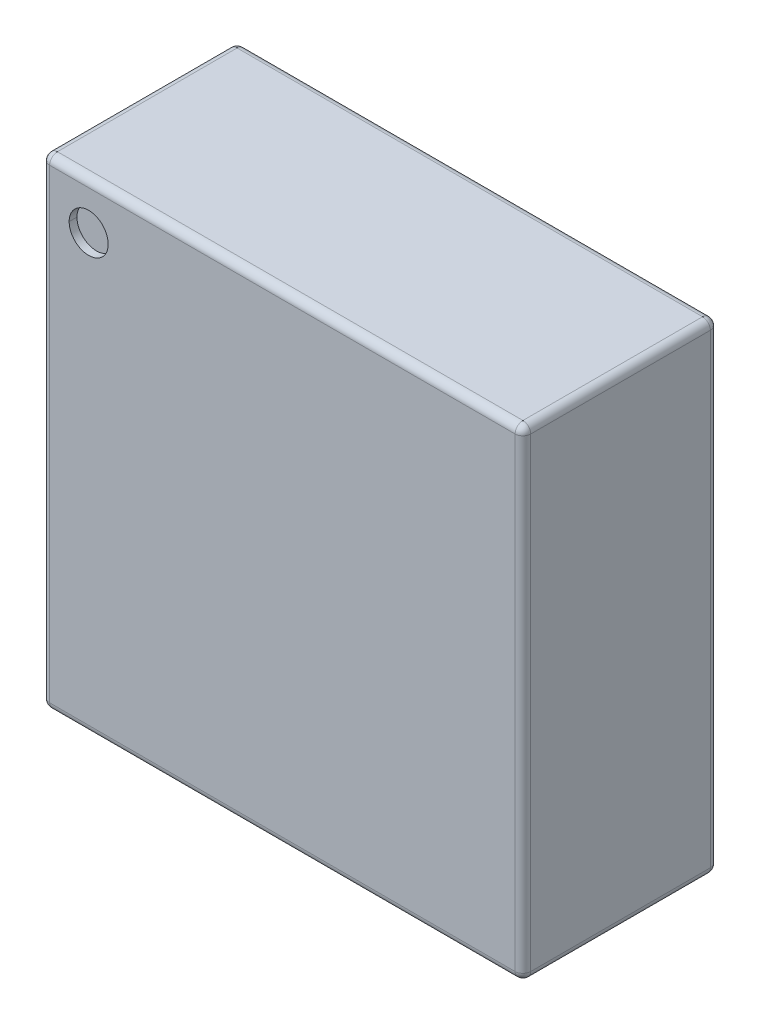
ISO-10303-21;
HEADER;
FILE_DESCRIPTION(('STEP AP214'),'2;1');
FILE_NAME('part.step','',(''),(''),'','','');
FILE_SCHEMA(('AUTOMOTIVE_DESIGN { 1 0 10303 214 1 1 1 1 }'));
ENDSEC;
DATA;
#1=APPLICATION_CONTEXT('core data for automotive mechanical design processes');
#2=APPLICATION_PROTOCOL_DEFINITION('international standard','automotive_design',2000,#1);
#3=PRODUCT_CONTEXT('',#1,'mechanical');
#4=PRODUCT('Part','Part','',(#3));
#5=PRODUCT_RELATED_PRODUCT_CATEGORY('part','',(#4));
#6=PRODUCT_DEFINITION_FORMATION('','',#4);
#7=PRODUCT_DEFINITION_CONTEXT('part definition',#1,'design');
#8=PRODUCT_DEFINITION('design','',#6,#7);
#9=PRODUCT_DEFINITION_SHAPE('','',#8);
#10=(LENGTH_UNIT() NAMED_UNIT(*) SI_UNIT(.MILLI.,.METRE.));
#11=(NAMED_UNIT(*) PLANE_ANGLE_UNIT() SI_UNIT($,.RADIAN.));
#12=(NAMED_UNIT(*) SI_UNIT($,.STERADIAN.) SOLID_ANGLE_UNIT());
#13=UNCERTAINTY_MEASURE_WITH_UNIT(LENGTH_MEASURE(1.E-05),#10,'distance_accuracy_value','');
#14=(GEOMETRIC_REPRESENTATION_CONTEXT(3) GLOBAL_UNCERTAINTY_ASSIGNED_CONTEXT((#13)) GLOBAL_UNIT_ASSIGNED_CONTEXT((#10,
#11,#12)) REPRESENTATION_CONTEXT('',''));
#15=CARTESIAN_POINT('',(0.,0.,0.));
#16=DIRECTION('',(0.,0.,1.));
#17=DIRECTION('',(1.,0.,0.));
#18=AXIS2_PLACEMENT_3D('',#15,#16,#17);
#19=CARTESIAN_POINT('',(-0.248,0.248,0.24));
#20=DIRECTION('',(0.,0.,1.));
#21=DIRECTION('',(1.,0.,0.));
#22=AXIS2_PLACEMENT_3D('',#19,#20,#21);
#23=CYLINDRICAL_SURFACE('',#22,0.025);
#24=CARTESIAN_POINT('',(-0.248,0.248,0.24));
#25=DIRECTION('',(0.,0.,1.));
#26=DIRECTION('',(1.,0.,0.));
#27=AXIS2_PLACEMENT_3D('',#24,#25,#26);
#28=CIRCLE('',#27,0.025);
#29=CARTESIAN_POINT('',(-0.273,0.248,0.24));
#30=VERTEX_POINT('',#29);
#31=CARTESIAN_POINT('',(-0.223,0.248,0.24));
#32=VERTEX_POINT('',#31);
#33=EDGE_CURVE('E11',#30,#32,#28,.T.);
#34=ORIENTED_EDGE('',*,*,#33,.F.);
#35=DIRECTION('',(0.,0.,1.));
#36=VECTOR('',#35,1.);
#37=CARTESIAN_POINT('',(-0.273,0.248,0.24));
#38=LINE('',#37,#36);
#39=CARTESIAN_POINT('',(-0.273,0.248,0.25));
#40=VERTEX_POINT('',#39);
#41=EDGE_CURVE('E24',#30,#40,#38,.T.);
#42=ORIENTED_EDGE('',*,*,#41,.T.);
#43=CARTESIAN_POINT('',(-0.248,0.248,0.25));
#44=DIRECTION('',(0.,0.,1.));
#45=DIRECTION('',(1.,0.,0.));
#46=AXIS2_PLACEMENT_3D('',#43,#44,#45);
#47=CIRCLE('',#46,0.025);
#48=CARTESIAN_POINT('',(-0.223,0.248,0.25));
#49=VERTEX_POINT('',#48);
#50=EDGE_CURVE('E257',#40,#49,#47,.T.);
#51=ORIENTED_EDGE('',*,*,#50,.T.);
#52=DIRECTION('',(0.,0.,1.));
#53=VECTOR('',#52,1.);
#54=CARTESIAN_POINT('',(-0.223,0.248,0.24));
#55=LINE('',#54,#53);
#56=EDGE_CURVE('E37',#32,#49,#55,.T.);
#57=ORIENTED_EDGE('',*,*,#56,.F.);
#58=EDGE_LOOP('',(#34,#42,#51,#57));
#59=FACE_BOUND('',#58,.T.);
#60=ADVANCED_FACE('F17',(#59),#23,.F.);
#61=CARTESIAN_POINT('',(0.308,-0.308,0.25));
#62=DIRECTION('',(-1.,0.,0.));
#63=DIRECTION('',(0.,0.,1.));
#64=AXIS2_PLACEMENT_3D('',#61,#62,#63);
#65=PLANE('',#64);
#66=DIRECTION('',(0.,0.,-1.));
#67=VECTOR('',#66,1.);
#68=CARTESIAN_POINT('',(0.308,-0.298,0.25));
#69=LINE('',#68,#67);
#70=CARTESIAN_POINT('',(0.308,-0.298,0.24));
#71=VERTEX_POINT('',#70);
#72=CARTESIAN_POINT('',(0.308,-0.298,0.01));
#73=VERTEX_POINT('',#72);
#74=EDGE_CURVE('E254',#71,#73,#69,.T.);
#75=ORIENTED_EDGE('',*,*,#74,.T.);
#76=DIRECTION('',(0.,1.,0.));
#77=VECTOR('',#76,1.);
#78=CARTESIAN_POINT('',(0.308,0.298,0.01));
#79=LINE('',#78,#77);
#80=CARTESIAN_POINT('',(0.308,0.298,0.01));
#81=VERTEX_POINT('',#80);
#82=EDGE_CURVE('E252',#73,#81,#79,.T.);
#83=ORIENTED_EDGE('',*,*,#82,.T.);
#84=DIRECTION('',(0.,0.,1.));
#85=VECTOR('',#84,1.);
#86=CARTESIAN_POINT('',(0.308,0.298,0.25));
#87=LINE('',#86,#85);
#88=CARTESIAN_POINT('',(0.308,0.298,0.24));
#89=VERTEX_POINT('',#88);
#90=EDGE_CURVE('E250',#81,#89,#87,.T.);
#91=ORIENTED_EDGE('',*,*,#90,.T.);
#92=DIRECTION('',(0.,-1.,0.));
#93=VECTOR('',#92,1.);
#94=CARTESIAN_POINT('',(0.308,-0.308,0.24));
#95=LINE('',#94,#93);
#96=EDGE_CURVE('E247',#89,#71,#95,.T.);
#97=ORIENTED_EDGE('',*,*,#96,.T.);
#98=EDGE_LOOP('',(#75,#83,#91,#97));
#99=FACE_BOUND('',#98,.T.);
#100=ADVANCED_FACE('F331',(#99),#65,.F.);
#101=CARTESIAN_POINT('',(-0.308,0.308,0.25));
#102=DIRECTION('',(0.,-1.,0.));
#103=DIRECTION('',(0.,0.,-1.));
#104=AXIS2_PLACEMENT_3D('',#101,#102,#103);
#105=PLANE('',#104);
#106=DIRECTION('',(0.,0.,-1.));
#107=VECTOR('',#106,1.);
#108=CARTESIAN_POINT('',(0.298,0.308,0.25));
#109=LINE('',#108,#107);
#110=CARTESIAN_POINT('',(0.298,0.308,0.24));
#111=VERTEX_POINT('',#110);
#112=CARTESIAN_POINT('',(0.298,0.308,0.01));
#113=VERTEX_POINT('',#112);
#114=EDGE_CURVE('E245',#111,#113,#109,.T.);
#115=ORIENTED_EDGE('',*,*,#114,.T.);
#116=DIRECTION('',(-1.,0.,0.));
#117=VECTOR('',#116,1.);
#118=CARTESIAN_POINT('',(-0.298,0.308,0.01));
#119=LINE('',#118,#117);
#120=CARTESIAN_POINT('',(-0.298,0.308,0.01));
#121=VERTEX_POINT('',#120);
#122=EDGE_CURVE('E151',#113,#121,#119,.T.);
#123=ORIENTED_EDGE('',*,*,#122,.T.);
#124=DIRECTION('',(0.,0.,1.));
#125=VECTOR('',#124,1.);
#126=CARTESIAN_POINT('',(-0.298,0.308,0.25));
#127=LINE('',#126,#125);
#128=CARTESIAN_POINT('',(-0.298,0.308,0.24));
#129=VERTEX_POINT('',#128);
#130=EDGE_CURVE('E242',#121,#129,#127,.T.);
#131=ORIENTED_EDGE('',*,*,#130,.T.);
#132=DIRECTION('',(1.,0.,0.));
#133=VECTOR('',#132,1.);
#134=CARTESIAN_POINT('',(-0.308,0.308,0.24));
#135=LINE('',#134,#133);
#136=EDGE_CURVE('E239',#129,#111,#135,.T.);
#137=ORIENTED_EDGE('',*,*,#136,.T.);
#138=EDGE_LOOP('',(#115,#123,#131,#137));
#139=FACE_BOUND('',#138,.T.);
#140=ADVANCED_FACE('F313',(#139),#105,.F.);
#141=CARTESIAN_POINT('',(-0.308,-0.308,0.25));
#142=DIRECTION('',(1.,0.,0.));
#143=DIRECTION('',(0.,0.,-1.));
#144=AXIS2_PLACEMENT_3D('',#141,#142,#143);
#145=PLANE('',#144);
#146=DIRECTION('',(0.,0.,-1.));
#147=VECTOR('',#146,1.);
#148=CARTESIAN_POINT('',(-0.308,0.298,0.25));
#149=LINE('',#148,#147);
#150=CARTESIAN_POINT('',(-0.308,0.298,0.24));
#151=VERTEX_POINT('',#150);
#152=CARTESIAN_POINT('',(-0.308,0.298,0.01));
#153=VERTEX_POINT('',#152);
#154=EDGE_CURVE('E237',#151,#153,#149,.T.);
#155=ORIENTED_EDGE('',*,*,#154,.T.);
#156=DIRECTION('',(0.,-1.,0.));
#157=VECTOR('',#156,1.);
#158=CARTESIAN_POINT('',(-0.308,-0.298,0.01));
#159=LINE('',#158,#157);
#160=CARTESIAN_POINT('',(-0.308,-0.298,0.01));
#161=VERTEX_POINT('',#160);
#162=EDGE_CURVE('E235',#153,#161,#159,.T.);
#163=ORIENTED_EDGE('',*,*,#162,.T.);
#164=DIRECTION('',(0.,0.,1.));
#165=VECTOR('',#164,1.);
#166=CARTESIAN_POINT('',(-0.308,-0.298,0.25));
#167=LINE('',#166,#165);
#168=CARTESIAN_POINT('',(-0.308,-0.298,0.24));
#169=VERTEX_POINT('',#168);
#170=EDGE_CURVE('E233',#161,#169,#167,.T.);
#171=ORIENTED_EDGE('',*,*,#170,.T.);
#172=DIRECTION('',(0.,1.,0.));
#173=VECTOR('',#172,1.);
#174=CARTESIAN_POINT('',(-0.308,-0.308,0.24));
#175=LINE('',#174,#173);
#176=EDGE_CURVE('E230',#169,#151,#175,.T.);
#177=ORIENTED_EDGE('',*,*,#176,.T.);
#178=EDGE_LOOP('',(#155,#163,#171,#177));
#179=FACE_BOUND('',#178,.T.);
#180=ADVANCED_FACE('F339',(#179),#145,.F.);
#181=CARTESIAN_POINT('',(-0.308,-0.308,0.25));
#182=DIRECTION('',(0.,1.,0.));
#183=DIRECTION('',(0.,0.,1.));
#184=AXIS2_PLACEMENT_3D('',#181,#182,#183);
#185=PLANE('',#184);
#186=DIRECTION('',(0.,0.,-1.));
#187=VECTOR('',#186,1.);
#188=CARTESIAN_POINT('',(-0.298,-0.308,0.25));
#189=LINE('',#188,#187);
#190=CARTESIAN_POINT('',(-0.298,-0.308,0.24));
#191=VERTEX_POINT('',#190);
#192=CARTESIAN_POINT('',(-0.298,-0.308,0.01));
#193=VERTEX_POINT('',#192);
#194=EDGE_CURVE('E228',#191,#193,#189,.T.);
#195=ORIENTED_EDGE('',*,*,#194,.T.);
#196=DIRECTION('',(1.,0.,0.));
#197=VECTOR('',#196,1.);
#198=CARTESIAN_POINT('',(0.298,-0.308,0.01));
#199=LINE('',#198,#197);
#200=CARTESIAN_POINT('',(0.298,-0.308,0.01));
#201=VERTEX_POINT('',#200);
#202=EDGE_CURVE('E226',#193,#201,#199,.T.);
#203=ORIENTED_EDGE('',*,*,#202,.T.);
#204=DIRECTION('',(0.,0.,1.));
#205=VECTOR('',#204,1.);
#206=CARTESIAN_POINT('',(0.298,-0.308,0.25));
#207=LINE('',#206,#205);
#208=CARTESIAN_POINT('',(0.298,-0.308,0.24));
#209=VERTEX_POINT('',#208);
#210=EDGE_CURVE('E224',#201,#209,#207,.T.);
#211=ORIENTED_EDGE('',*,*,#210,.T.);
#212=DIRECTION('',(-1.,0.,0.));
#213=VECTOR('',#212,1.);
#214=CARTESIAN_POINT('',(-0.308,-0.308,0.24));
#215=LINE('',#214,#213);
#216=EDGE_CURVE('E221',#209,#191,#215,.T.);
#217=ORIENTED_EDGE('',*,*,#216,.T.);
#218=EDGE_LOOP('',(#195,#203,#211,#217));
#219=FACE_BOUND('',#218,.T.);
#220=ADVANCED_FACE('F264',(#219),#185,.F.);
#221=CARTESIAN_POINT('',(0.,0.,0.25));
#222=DIRECTION('',(0.,0.,-1.));
#223=DIRECTION('',(-1.,0.,0.));
#224=AXIS2_PLACEMENT_3D('',#221,#222,#223);
#225=PLANE('',#224);
#226=CARTESIAN_POINT('',(-0.248,0.248,0.25));
#227=DIRECTION('',(0.,0.,1.));
#228=DIRECTION('',(1.,0.,0.));
#229=AXIS2_PLACEMENT_3D('',#226,#227,#228);
#230=CIRCLE('',#229,0.025);
#231=EDGE_CURVE('E219',#49,#40,#230,.T.);
#232=ORIENTED_EDGE('',*,*,#231,.F.);
#233=ORIENTED_EDGE('',*,*,#50,.F.);
#234=EDGE_LOOP('',(#232,#233));
#235=FACE_BOUND('',#234,.T.);
#236=DIRECTION('',(0.,-1.,0.));
#237=VECTOR('',#236,1.);
#238=CARTESIAN_POINT('',(-0.298,0.,0.25));
#239=LINE('',#238,#237);
#240=CARTESIAN_POINT('',(-0.298,0.298,0.25));
#241=VERTEX_POINT('',#240);
#242=CARTESIAN_POINT('',(-0.298,-0.298,0.25));
#243=VERTEX_POINT('',#242);
#244=EDGE_CURVE('E217',#241,#243,#239,.T.);
#245=ORIENTED_EDGE('',*,*,#244,.T.);
#246=DIRECTION('',(1.,0.,0.));
#247=VECTOR('',#246,1.);
#248=CARTESIAN_POINT('',(0.,-0.298,0.25));
#249=LINE('',#248,#247);
#250=CARTESIAN_POINT('',(0.298,-0.298,0.25));
#251=VERTEX_POINT('',#250);
#252=EDGE_CURVE('E215',#243,#251,#249,.T.);
#253=ORIENTED_EDGE('',*,*,#252,.T.);
#254=DIRECTION('',(0.,1.,0.));
#255=VECTOR('',#254,1.);
#256=CARTESIAN_POINT('',(0.298,0.,0.25));
#257=LINE('',#256,#255);
#258=CARTESIAN_POINT('',(0.298,0.298,0.25));
#259=VERTEX_POINT('',#258);
#260=EDGE_CURVE('E213',#251,#259,#257,.T.);
#261=ORIENTED_EDGE('',*,*,#260,.T.);
#262=DIRECTION('',(-1.,0.,0.));
#263=VECTOR('',#262,1.);
#264=CARTESIAN_POINT('',(0.,0.298,0.25));
#265=LINE('',#264,#263);
#266=EDGE_CURVE('E210',#259,#241,#265,.T.);
#267=ORIENTED_EDGE('',*,*,#266,.T.);
#268=EDGE_LOOP('',(#245,#253,#261,#267));
#269=FACE_BOUND('',#268,.T.);
#270=ADVANCED_FACE('F261',(#235,#269),#225,.F.);
#271=CARTESIAN_POINT('',(0.,0.,0.));
#272=DIRECTION('',(0.,0.,-1.));
#273=DIRECTION('',(-1.,0.,0.));
#274=AXIS2_PLACEMENT_3D('',#271,#272,#273);
#275=PLANE('',#274);
#276=DIRECTION('',(-1.,0.,0.));
#277=VECTOR('',#276,1.);
#278=CARTESIAN_POINT('',(-0.298,-0.298,0.));
#279=LINE('',#278,#277);
#280=CARTESIAN_POINT('',(0.298,-0.298,0.));
#281=VERTEX_POINT('',#280);
#282=CARTESIAN_POINT('',(-0.298,-0.298,0.));
#283=VERTEX_POINT('',#282);
#284=EDGE_CURVE('E208',#281,#283,#279,.T.);
#285=ORIENTED_EDGE('',*,*,#284,.T.);
#286=DIRECTION('',(0.,1.,0.));
#287=VECTOR('',#286,1.);
#288=CARTESIAN_POINT('',(-0.298,0.298,0.));
#289=LINE('',#288,#287);
#290=CARTESIAN_POINT('',(-0.298,0.298,0.));
#291=VERTEX_POINT('',#290);
#292=EDGE_CURVE('E123',#283,#291,#289,.T.);
#293=ORIENTED_EDGE('',*,*,#292,.T.);
#294=DIRECTION('',(1.,0.,0.));
#295=VECTOR('',#294,1.);
#296=CARTESIAN_POINT('',(0.298,0.298,0.));
#297=LINE('',#296,#295);
#298=CARTESIAN_POINT('',(0.298,0.298,0.));
#299=VERTEX_POINT('',#298);
#300=EDGE_CURVE('E117',#291,#299,#297,.T.);
#301=ORIENTED_EDGE('',*,*,#300,.T.);
#302=DIRECTION('',(0.,-1.,0.));
#303=VECTOR('',#302,1.);
#304=CARTESIAN_POINT('',(0.298,-0.298,0.));
#305=LINE('',#304,#303);
#306=EDGE_CURVE('E120',#299,#281,#305,.T.);
#307=ORIENTED_EDGE('',*,*,#306,.T.);
#308=EDGE_LOOP('',(#285,#293,#301,#307));
#309=FACE_BOUND('',#308,.T.);
#310=ADVANCED_FACE('F119',(#309),#275,.T.);
#311=CARTESIAN_POINT('',(-0.298,0.298,0.25));
#312=DIRECTION('',(0.,0.,-1.));
#313=DIRECTION('',(-1.,0.,0.));
#314=AXIS2_PLACEMENT_3D('',#311,#312,#313);
#315=CYLINDRICAL_SURFACE('',#314,0.01);
#316=ORIENTED_EDGE('',*,*,#130,.F.);
#317=CARTESIAN_POINT('',(-0.298,0.298,0.01));
#318=DIRECTION('',(0.,0.,1.));
#319=DIRECTION('',(-1.,0.,0.));
#320=AXIS2_PLACEMENT_3D('',#317,#318,#319);
#321=CIRCLE('',#320,0.01);
#322=EDGE_CURVE('E138',#121,#153,#321,.T.);
#323=ORIENTED_EDGE('',*,*,#322,.T.);
#324=ORIENTED_EDGE('',*,*,#154,.F.);
#325=CARTESIAN_POINT('',(-0.298,0.298,0.24));
#326=DIRECTION('',(0.,0.,1.));
#327=DIRECTION('',(1.,0.,0.));
#328=AXIS2_PLACEMENT_3D('',#325,#326,#327);
#329=CIRCLE('',#328,0.01);
#330=EDGE_CURVE('E202',#129,#151,#329,.T.);
#331=ORIENTED_EDGE('',*,*,#330,.F.);
#332=EDGE_LOOP('',(#316,#323,#324,#331));
#333=FACE_BOUND('',#332,.T.);
#334=ADVANCED_FACE('F317',(#333),#315,.T.);
#335=CARTESIAN_POINT('',(0.,0.298,0.24));
#336=DIRECTION('',(-1.,0.,0.));
#337=DIRECTION('',(0.,0.,1.));
#338=AXIS2_PLACEMENT_3D('',#335,#336,#337);
#339=CYLINDRICAL_SURFACE('',#338,0.01);
#340=CARTESIAN_POINT('',(0.298,0.298,0.24));
#341=DIRECTION('',(1.,0.,0.));
#342=DIRECTION('',(0.,0.,-1.));
#343=AXIS2_PLACEMENT_3D('',#340,#341,#342);
#344=CIRCLE('',#343,0.01);
#345=EDGE_CURVE('E199',#111,#259,#344,.T.);
#346=ORIENTED_EDGE('',*,*,#345,.F.);
#347=ORIENTED_EDGE('',*,*,#136,.F.);
#348=CARTESIAN_POINT('',(-0.298,0.298,0.24));
#349=DIRECTION('',(-1.,0.,0.));
#350=DIRECTION('',(0.,0.,1.));
#351=AXIS2_PLACEMENT_3D('',#348,#349,#350);
#352=CIRCLE('',#351,0.01);
#353=EDGE_CURVE('E196',#241,#129,#352,.T.);
#354=ORIENTED_EDGE('',*,*,#353,.F.);
#355=ORIENTED_EDGE('',*,*,#266,.F.);
#356=EDGE_LOOP('',(#346,#347,#354,#355));
#357=FACE_BOUND('',#356,.T.);
#358=ADVANCED_FACE('F304',(#357),#339,.T.);
#359=CARTESIAN_POINT('',(0.298,0.298,0.25));
#360=DIRECTION('',(0.,0.,-1.));
#361=DIRECTION('',(-1.,0.,0.));
#362=AXIS2_PLACEMENT_3D('',#359,#360,#361);
#363=CYLINDRICAL_SURFACE('',#362,0.01);
#364=ORIENTED_EDGE('',*,*,#90,.F.);
#365=CARTESIAN_POINT('',(0.298,0.298,0.01));
#366=DIRECTION('',(0.,0.,1.));
#367=DIRECTION('',(-1.,0.,0.));
#368=AXIS2_PLACEMENT_3D('',#365,#366,#367);
#369=CIRCLE('',#368,0.01);
#370=EDGE_CURVE('E146',#81,#113,#369,.T.);
#371=ORIENTED_EDGE('',*,*,#370,.T.);
#372=ORIENTED_EDGE('',*,*,#114,.F.);
#373=CARTESIAN_POINT('',(0.298,0.298,0.24));
#374=DIRECTION('',(0.,0.,1.));
#375=DIRECTION('',(1.,0.,0.));
#376=AXIS2_PLACEMENT_3D('',#373,#374,#375);
#377=CIRCLE('',#376,0.01);
#378=EDGE_CURVE('E192',#89,#111,#377,.T.);
#379=ORIENTED_EDGE('',*,*,#378,.F.);
#380=EDGE_LOOP('',(#364,#371,#372,#379));
#381=FACE_BOUND('',#380,.T.);
#382=ADVANCED_FACE('F311',(#381),#363,.T.);
#383=CARTESIAN_POINT('',(-0.298,0.298,0.24));
#384=DIRECTION('',(0.,1.,0.));
#385=DIRECTION('',(1.,0.,0.));
#386=AXIS2_PLACEMENT_3D('',#383,#384,#385);
#387=SPHERICAL_SURFACE('',#386,0.01);
#388=ORIENTED_EDGE('',*,*,#353,.T.);
#389=ORIENTED_EDGE('',*,*,#330,.T.);
#390=CARTESIAN_POINT('',(-0.298,0.298,0.24));
#391=DIRECTION('',(0.,-1.,0.));
#392=DIRECTION('',(0.,0.,1.));
#393=AXIS2_PLACEMENT_3D('',#390,#391,#392);
#394=CIRCLE('',#393,0.01);
#395=EDGE_CURVE('E189',#241,#151,#394,.T.);
#396=ORIENTED_EDGE('',*,*,#395,.F.);
#397=EDGE_LOOP('',(#388,#389,#396));
#398=FACE_BOUND('',#397,.T.);
#399=ADVANCED_FACE('F320',(#398),#387,.T.);
#400=CARTESIAN_POINT('',(0.298,0.298,0.24));
#401=DIRECTION('',(0.,1.,0.));
#402=DIRECTION('',(1.,0.,0.));
#403=AXIS2_PLACEMENT_3D('',#400,#401,#402);
#404=SPHERICAL_SURFACE('',#403,0.01);
#405=ORIENTED_EDGE('',*,*,#378,.T.);
#406=ORIENTED_EDGE('',*,*,#345,.T.);
#407=CARTESIAN_POINT('',(0.298,0.298,0.24));
#408=DIRECTION('',(0.,-1.,0.));
#409=DIRECTION('',(0.,0.,1.));
#410=AXIS2_PLACEMENT_3D('',#407,#408,#409);
#411=CIRCLE('',#410,0.01);
#412=EDGE_CURVE('E186',#89,#259,#411,.T.);
#413=ORIENTED_EDGE('',*,*,#412,.F.);
#414=EDGE_LOOP('',(#405,#406,#413));
#415=FACE_BOUND('',#414,.T.);
#416=ADVANCED_FACE('F308',(#415),#404,.T.);
#417=CARTESIAN_POINT('',(-0.298,-0.298,0.25));
#418=DIRECTION('',(0.,0.,-1.));
#419=DIRECTION('',(-1.,0.,0.));
#420=AXIS2_PLACEMENT_3D('',#417,#418,#419);
#421=CYLINDRICAL_SURFACE('',#420,0.01);
#422=ORIENTED_EDGE('',*,*,#170,.F.);
#423=CARTESIAN_POINT('',(-0.298,-0.298,0.01));
#424=DIRECTION('',(0.,0.,1.));
#425=DIRECTION('',(-1.,0.,0.));
#426=AXIS2_PLACEMENT_3D('',#423,#424,#425);
#427=CIRCLE('',#426,0.01);
#428=EDGE_CURVE('E183',#161,#193,#427,.T.);
#429=ORIENTED_EDGE('',*,*,#428,.T.);
#430=ORIENTED_EDGE('',*,*,#194,.F.);
#431=CARTESIAN_POINT('',(-0.298,-0.298,0.24));
#432=DIRECTION('',(0.,0.,1.));
#433=DIRECTION('',(1.,0.,0.));
#434=AXIS2_PLACEMENT_3D('',#431,#432,#433);
#435=CIRCLE('',#434,0.01);
#436=EDGE_CURVE('E180',#169,#191,#435,.T.);
#437=ORIENTED_EDGE('',*,*,#436,.F.);
#438=EDGE_LOOP('',(#422,#429,#430,#437));
#439=FACE_BOUND('',#438,.T.);
#440=ADVANCED_FACE('F284',(#439),#421,.T.);
#441=CARTESIAN_POINT('',(-0.298,0.,0.24));
#442=DIRECTION('',(0.,-1.,0.));
#443=DIRECTION('',(0.,0.,-1.));
#444=AXIS2_PLACEMENT_3D('',#441,#442,#443);
#445=CYLINDRICAL_SURFACE('',#444,0.01);
#446=ORIENTED_EDGE('',*,*,#395,.T.);
#447=ORIENTED_EDGE('',*,*,#176,.F.);
#448=CARTESIAN_POINT('',(-0.298,-0.298,0.24));
#449=DIRECTION('',(0.,-1.,0.));
#450=DIRECTION('',(0.,0.,-1.));
#451=AXIS2_PLACEMENT_3D('',#448,#449,#450);
#452=CIRCLE('',#451,0.01);
#453=EDGE_CURVE('E177',#243,#169,#452,.T.);
#454=ORIENTED_EDGE('',*,*,#453,.F.);
#455=ORIENTED_EDGE('',*,*,#244,.F.);
#456=EDGE_LOOP('',(#446,#447,#454,#455));
#457=FACE_BOUND('',#456,.T.);
#458=ADVANCED_FACE('F278',(#457),#445,.T.);
#459=CARTESIAN_POINT('',(0.298,0.,0.24));
#460=DIRECTION('',(0.,1.,0.));
#461=DIRECTION('',(0.,0.,1.));
#462=AXIS2_PLACEMENT_3D('',#459,#460,#461);
#463=CYLINDRICAL_SURFACE('',#462,0.01);
#464=ORIENTED_EDGE('',*,*,#412,.T.);
#465=ORIENTED_EDGE('',*,*,#260,.F.);
#466=CARTESIAN_POINT('',(0.298,-0.298,0.24));
#467=DIRECTION('',(0.,-1.,0.));
#468=DIRECTION('',(0.,0.,-1.));
#469=AXIS2_PLACEMENT_3D('',#466,#467,#468);
#470=CIRCLE('',#469,0.01);
#471=EDGE_CURVE('E174',#71,#251,#470,.T.);
#472=ORIENTED_EDGE('',*,*,#471,.F.);
#473=ORIENTED_EDGE('',*,*,#96,.F.);
#474=EDGE_LOOP('',(#464,#465,#472,#473));
#475=FACE_BOUND('',#474,.T.);
#476=ADVANCED_FACE('F299',(#475),#463,.T.);
#477=CARTESIAN_POINT('',(0.298,-0.298,0.25));
#478=DIRECTION('',(0.,0.,-1.));
#479=DIRECTION('',(-1.,0.,0.));
#480=AXIS2_PLACEMENT_3D('',#477,#478,#479);
#481=CYLINDRICAL_SURFACE('',#480,0.01);
#482=ORIENTED_EDGE('',*,*,#210,.F.);
#483=CARTESIAN_POINT('',(0.298,-0.298,0.01));
#484=DIRECTION('',(0.,0.,1.));
#485=DIRECTION('',(-1.,0.,0.));
#486=AXIS2_PLACEMENT_3D('',#483,#484,#485);
#487=CIRCLE('',#486,0.01);
#488=EDGE_CURVE('E171',#201,#73,#487,.T.);
#489=ORIENTED_EDGE('',*,*,#488,.T.);
#490=ORIENTED_EDGE('',*,*,#74,.F.);
#491=CARTESIAN_POINT('',(0.298,-0.298,0.24));
#492=DIRECTION('',(0.,0.,1.));
#493=DIRECTION('',(1.,0.,0.));
#494=AXIS2_PLACEMENT_3D('',#491,#492,#493);
#495=CIRCLE('',#494,0.01);
#496=EDGE_CURVE('E168',#209,#71,#495,.T.);
#497=ORIENTED_EDGE('',*,*,#496,.F.);
#498=EDGE_LOOP('',(#482,#489,#490,#497));
#499=FACE_BOUND('',#498,.T.);
#500=ADVANCED_FACE('F292',(#499),#481,.T.);
#501=CARTESIAN_POINT('',(-0.298,-0.298,0.24));
#502=DIRECTION('',(0.,1.,0.));
#503=DIRECTION('',(1.,0.,0.));
#504=AXIS2_PLACEMENT_3D('',#501,#502,#503);
#505=SPHERICAL_SURFACE('',#504,0.01);
#506=ORIENTED_EDGE('',*,*,#453,.T.);
#507=ORIENTED_EDGE('',*,*,#436,.T.);
#508=CARTESIAN_POINT('',(-0.298,-0.298,0.24));
#509=DIRECTION('',(1.,0.,0.));
#510=DIRECTION('',(0.,0.,1.));
#511=AXIS2_PLACEMENT_3D('',#508,#509,#510);
#512=CIRCLE('',#511,0.01);
#513=EDGE_CURVE('E165',#243,#191,#512,.T.);
#514=ORIENTED_EDGE('',*,*,#513,.F.);
#515=EDGE_LOOP('',(#506,#507,#514));
#516=FACE_BOUND('',#515,.T.);
#517=ADVANCED_FACE('F281',(#516),#505,.T.);
#518=CARTESIAN_POINT('',(0.298,-0.298,0.24));
#519=DIRECTION('',(0.,1.,0.));
#520=DIRECTION('',(1.,0.,0.));
#521=AXIS2_PLACEMENT_3D('',#518,#519,#520);
#522=SPHERICAL_SURFACE('',#521,0.01);
#523=ORIENTED_EDGE('',*,*,#496,.T.);
#524=ORIENTED_EDGE('',*,*,#471,.T.);
#525=CARTESIAN_POINT('',(0.298,-0.298,0.24));
#526=DIRECTION('',(-1.,0.,0.));
#527=DIRECTION('',(0.,0.,-1.));
#528=AXIS2_PLACEMENT_3D('',#525,#526,#527);
#529=CIRCLE('',#528,0.01);
#530=EDGE_CURVE('E162',#209,#251,#529,.T.);
#531=ORIENTED_EDGE('',*,*,#530,.F.);
#532=EDGE_LOOP('',(#523,#524,#531));
#533=FACE_BOUND('',#532,.T.);
#534=ADVANCED_FACE('F295',(#533),#522,.T.);
#535=CARTESIAN_POINT('',(0.,-0.298,0.24));
#536=DIRECTION('',(1.,0.,0.));
#537=DIRECTION('',(0.,0.,-1.));
#538=AXIS2_PLACEMENT_3D('',#535,#536,#537);
#539=CYLINDRICAL_SURFACE('',#538,0.01);
#540=ORIENTED_EDGE('',*,*,#513,.T.);
#541=ORIENTED_EDGE('',*,*,#216,.F.);
#542=ORIENTED_EDGE('',*,*,#530,.T.);
#543=ORIENTED_EDGE('',*,*,#252,.F.);
#544=EDGE_LOOP('',(#540,#541,#542,#543));
#545=FACE_BOUND('',#544,.T.);
#546=ADVANCED_FACE('F273',(#545),#539,.T.);
#547=CARTESIAN_POINT('',(-0.248,0.248,0.24));
#548=DIRECTION('',(0.,0.,1.));
#549=DIRECTION('',(1.,0.,0.));
#550=AXIS2_PLACEMENT_3D('',#547,#548,#549);
#551=CYLINDRICAL_SURFACE('',#550,0.025);
#552=ORIENTED_EDGE('',*,*,#41,.F.);
#553=CARTESIAN_POINT('',(-0.248,0.248,0.24));
#554=DIRECTION('',(0.,0.,1.));
#555=DIRECTION('',(1.,0.,0.));
#556=AXIS2_PLACEMENT_3D('',#553,#554,#555);
#557=CIRCLE('',#556,0.025);
#558=EDGE_CURVE('E147',#32,#30,#557,.T.);
#559=ORIENTED_EDGE('',*,*,#558,.F.);
#560=ORIENTED_EDGE('',*,*,#56,.T.);
#561=ORIENTED_EDGE('',*,*,#231,.T.);
#562=EDGE_LOOP('',(#552,#559,#560,#561));
#563=FACE_BOUND('',#562,.T.);
#564=ADVANCED_FACE('F259',(#563),#551,.F.);
#565=CARTESIAN_POINT('',(-0.248,0.248,0.24));
#566=DIRECTION('',(0.,0.,1.));
#567=DIRECTION('',(1.,0.,0.));
#568=AXIS2_PLACEMENT_3D('',#565,#566,#567);
#569=PLANE('',#568);
#570=ORIENTED_EDGE('',*,*,#558,.T.);
#571=ORIENTED_EDGE('',*,*,#33,.T.);
#572=EDGE_LOOP('',(#570,#571));
#573=FACE_BOUND('',#572,.T.);
#574=ADVANCED_FACE('F440',(#573),#569,.T.);
#575=CARTESIAN_POINT('',(0.298,-0.308,0.01));
#576=DIRECTION('',(0.,-1.,0.));
#577=DIRECTION('',(0.,0.,-1.));
#578=AXIS2_PLACEMENT_3D('',#575,#576,#577);
#579=CYLINDRICAL_SURFACE('',#578,0.01);
#580=CARTESIAN_POINT('',(0.298,0.298,0.01));
#581=DIRECTION('',(0.,1.,0.));
#582=DIRECTION('',(0.,0.,1.));
#583=AXIS2_PLACEMENT_3D('',#580,#581,#582);
#584=CIRCLE('',#583,0.01);
#585=EDGE_CURVE('E134',#81,#299,#584,.T.);
#586=ORIENTED_EDGE('',*,*,#585,.F.);
#587=ORIENTED_EDGE('',*,*,#82,.F.);
#588=CARTESIAN_POINT('',(0.298,-0.298,0.01));
#589=DIRECTION('',(0.,-1.,0.));
#590=DIRECTION('',(0.,0.,-1.));
#591=AXIS2_PLACEMENT_3D('',#588,#589,#590);
#592=CIRCLE('',#591,0.01);
#593=EDGE_CURVE('E136',#281,#73,#592,.T.);
#594=ORIENTED_EDGE('',*,*,#593,.F.);
#595=ORIENTED_EDGE('',*,*,#306,.F.);
#596=EDGE_LOOP('',(#586,#587,#594,#595));
#597=FACE_BOUND('',#596,.T.);
#598=ADVANCED_FACE('F132',(#597),#579,.T.);
#599=CARTESIAN_POINT('',(0.298,0.298,0.01));
#600=DIRECTION('',(0.,1.,0.));
#601=DIRECTION('',(-1.,0.,0.));
#602=AXIS2_PLACEMENT_3D('',#599,#600,#601);
#603=SPHERICAL_SURFACE('',#602,0.01);
#604=ORIENTED_EDGE('',*,*,#370,.F.);
#605=ORIENTED_EDGE('',*,*,#585,.T.);
#606=CARTESIAN_POINT('',(0.298,0.298,0.01));
#607=DIRECTION('',(-1.,0.,0.));
#608=DIRECTION('',(0.,0.,1.));
#609=AXIS2_PLACEMENT_3D('',#606,#607,#608);
#610=CIRCLE('',#609,0.01);
#611=EDGE_CURVE('E144',#113,#299,#610,.T.);
#612=ORIENTED_EDGE('',*,*,#611,.F.);
#613=EDGE_LOOP('',(#604,#605,#612));
#614=FACE_BOUND('',#613,.T.);
#615=ADVANCED_FACE('F143',(#614),#603,.T.);
#616=CARTESIAN_POINT('',(0.298,-0.298,0.01));
#617=DIRECTION('',(0.,1.,0.));
#618=DIRECTION('',(-1.,0.,0.));
#619=AXIS2_PLACEMENT_3D('',#616,#617,#618);
#620=SPHERICAL_SURFACE('',#619,0.01);
#621=ORIENTED_EDGE('',*,*,#593,.T.);
#622=ORIENTED_EDGE('',*,*,#488,.F.);
#623=CARTESIAN_POINT('',(0.298,-0.298,0.01));
#624=DIRECTION('',(-1.,0.,0.));
#625=DIRECTION('',(0.,0.,1.));
#626=AXIS2_PLACEMENT_3D('',#623,#624,#625);
#627=CIRCLE('',#626,0.01);
#628=EDGE_CURVE('E152',#281,#201,#627,.T.);
#629=ORIENTED_EDGE('',*,*,#628,.F.);
#630=EDGE_LOOP('',(#621,#622,#629));
#631=FACE_BOUND('',#630,.T.);
#632=ADVANCED_FACE('F466',(#631),#620,.T.);
#633=CARTESIAN_POINT('',(-0.308,0.298,0.01));
#634=DIRECTION('',(1.,0.,0.));
#635=DIRECTION('',(0.,0.,-1.));
#636=AXIS2_PLACEMENT_3D('',#633,#634,#635);
#637=CYLINDRICAL_SURFACE('',#636,0.01);
#638=ORIENTED_EDGE('',*,*,#611,.T.);
#639=ORIENTED_EDGE('',*,*,#300,.F.);
#640=CARTESIAN_POINT('',(-0.298,0.298,0.01));
#641=DIRECTION('',(-1.,0.,0.));
#642=DIRECTION('',(0.,0.,1.));
#643=AXIS2_PLACEMENT_3D('',#640,#641,#642);
#644=CIRCLE('',#643,0.01);
#645=EDGE_CURVE('E156',#121,#291,#644,.T.);
#646=ORIENTED_EDGE('',*,*,#645,.F.);
#647=ORIENTED_EDGE('',*,*,#122,.F.);
#648=EDGE_LOOP('',(#638,#639,#646,#647));
#649=FACE_BOUND('',#648,.T.);
#650=ADVANCED_FACE('F150',(#649),#637,.T.);
#651=CARTESIAN_POINT('',(-0.308,-0.298,0.01));
#652=DIRECTION('',(-1.,0.,0.));
#653=DIRECTION('',(0.,0.,1.));
#654=AXIS2_PLACEMENT_3D('',#651,#652,#653);
#655=CYLINDRICAL_SURFACE('',#654,0.01);
#656=ORIENTED_EDGE('',*,*,#628,.T.);
#657=ORIENTED_EDGE('',*,*,#202,.F.);
#658=CARTESIAN_POINT('',(-0.298,-0.298,0.01));
#659=DIRECTION('',(-1.,0.,0.));
#660=DIRECTION('',(0.,0.,1.));
#661=AXIS2_PLACEMENT_3D('',#658,#659,#660);
#662=CIRCLE('',#661,0.01);
#663=EDGE_CURVE('E535',#283,#193,#662,.T.);
#664=ORIENTED_EDGE('',*,*,#663,.F.);
#665=ORIENTED_EDGE('',*,*,#284,.F.);
#666=EDGE_LOOP('',(#656,#657,#664,#665));
#667=FACE_BOUND('',#666,.T.);
#668=ADVANCED_FACE('F484',(#667),#655,.T.);
#669=CARTESIAN_POINT('',(-0.298,0.298,0.01));
#670=DIRECTION('',(0.,1.,0.));
#671=DIRECTION('',(-1.,0.,0.));
#672=AXIS2_PLACEMENT_3D('',#669,#670,#671);
#673=SPHERICAL_SURFACE('',#672,0.01);
#674=ORIENTED_EDGE('',*,*,#322,.F.);
#675=ORIENTED_EDGE('',*,*,#645,.T.);
#676=CARTESIAN_POINT('',(-0.298,0.298,0.01));
#677=DIRECTION('',(0.,-1.,0.));
#678=DIRECTION('',(0.,0.,-1.));
#679=AXIS2_PLACEMENT_3D('',#676,#677,#678);
#680=CIRCLE('',#679,0.01);
#681=EDGE_CURVE('E532',#153,#291,#680,.T.);
#682=ORIENTED_EDGE('',*,*,#681,.F.);
#683=EDGE_LOOP('',(#674,#675,#682));
#684=FACE_BOUND('',#683,.T.);
#685=ADVANCED_FACE('F493',(#684),#673,.T.);
#686=CARTESIAN_POINT('',(-0.298,-0.298,0.01));
#687=DIRECTION('',(0.,1.,0.));
#688=DIRECTION('',(-1.,0.,0.));
#689=AXIS2_PLACEMENT_3D('',#686,#687,#688);
#690=SPHERICAL_SURFACE('',#689,0.01);
#691=ORIENTED_EDGE('',*,*,#663,.T.);
#692=ORIENTED_EDGE('',*,*,#428,.F.);
#693=CARTESIAN_POINT('',(-0.298,-0.298,0.01));
#694=DIRECTION('',(0.,1.,0.));
#695=DIRECTION('',(0.,0.,1.));
#696=AXIS2_PLACEMENT_3D('',#693,#694,#695);
#697=CIRCLE('',#696,0.01);
#698=EDGE_CURVE('E536',#283,#161,#697,.T.);
#699=ORIENTED_EDGE('',*,*,#698,.F.);
#700=EDGE_LOOP('',(#691,#692,#699));
#701=FACE_BOUND('',#700,.T.);
#702=ADVANCED_FACE('F503',(#701),#690,.T.);
#703=CARTESIAN_POINT('',(-0.298,-0.308,0.01));
#704=DIRECTION('',(0.,1.,0.));
#705=DIRECTION('',(0.,0.,1.));
#706=AXIS2_PLACEMENT_3D('',#703,#704,#705);
#707=CYLINDRICAL_SURFACE('',#706,0.01);
#708=ORIENTED_EDGE('',*,*,#681,.T.);
#709=ORIENTED_EDGE('',*,*,#292,.F.);
#710=ORIENTED_EDGE('',*,*,#698,.T.);
#711=ORIENTED_EDGE('',*,*,#162,.F.);
#712=EDGE_LOOP('',(#708,#709,#710,#711));
#713=FACE_BOUND('',#712,.T.);
#714=ADVANCED_FACE('F513',(#713),#707,.T.);
#715=CLOSED_SHELL('',(#60,#100,#140,#180,#220,#270,#310,#334,#358,#382,#399,#416,#440,#458,#476,
#500,#517,#534,#546,#564,#574,#598,#615,#632,#650,#668,#685,#702,#714));
#716=MANIFOLD_SOLID_BREP('B1',#715);
#717=ADVANCED_BREP_SHAPE_REPRESENTATION('',(#18,#716),#14);
#718=SHAPE_DEFINITION_REPRESENTATION(#9,#717);
ENDSEC;
END-ISO-10303-21;
